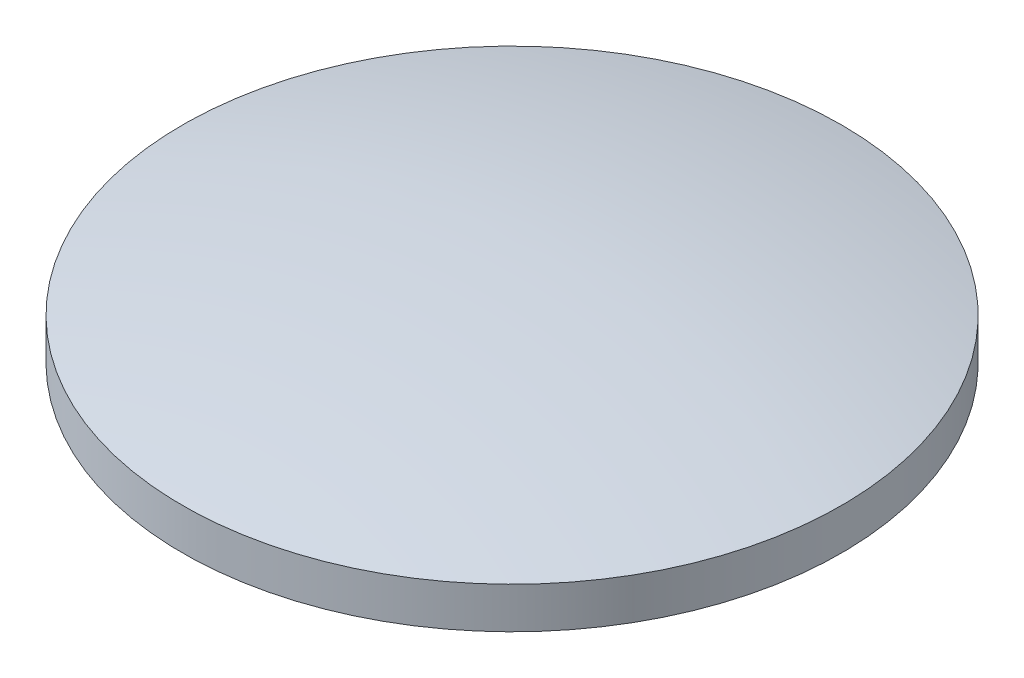
ISO-10303-21;
HEADER;
FILE_DESCRIPTION(('STEP AP214'),'2;1');
FILE_NAME('part.step','',(''),(''),'','','');
FILE_SCHEMA(('AUTOMOTIVE_DESIGN { 1 0 10303 214 1 1 1 1 }'));
ENDSEC;
DATA;
#1=APPLICATION_CONTEXT('core data for automotive mechanical design processes');
#2=APPLICATION_PROTOCOL_DEFINITION('international standard','automotive_design',2000,#1);
#3=PRODUCT_CONTEXT('',#1,'mechanical');
#4=PRODUCT('Part','Part','',(#3));
#5=PRODUCT_RELATED_PRODUCT_CATEGORY('part','',(#4));
#6=PRODUCT_DEFINITION_FORMATION('','',#4);
#7=PRODUCT_DEFINITION_CONTEXT('part definition',#1,'design');
#8=PRODUCT_DEFINITION('design','',#6,#7);
#9=PRODUCT_DEFINITION_SHAPE('','',#8);
#10=(LENGTH_UNIT() NAMED_UNIT(*) SI_UNIT(.MILLI.,.METRE.));
#11=(NAMED_UNIT(*) PLANE_ANGLE_UNIT() SI_UNIT($,.RADIAN.));
#12=(NAMED_UNIT(*) SI_UNIT($,.STERADIAN.) SOLID_ANGLE_UNIT());
#13=UNCERTAINTY_MEASURE_WITH_UNIT(LENGTH_MEASURE(1.E-05),#10,'distance_accuracy_value','');
#14=(GEOMETRIC_REPRESENTATION_CONTEXT(3) GLOBAL_UNCERTAINTY_ASSIGNED_CONTEXT((#13)) GLOBAL_UNIT_ASSIGNED_CONTEXT((#10,
#11,#12)) REPRESENTATION_CONTEXT('',''));
#15=CARTESIAN_POINT('',(0.,0.,0.));
#16=DIRECTION('',(0.,0.,1.));
#17=DIRECTION('',(1.,0.,0.));
#18=AXIS2_PLACEMENT_3D('',#15,#16,#17);
#19=CARTESIAN_POINT('',(0.,-31.,0.));
#20=DIRECTION('',(1.,0.,0.));
#21=DIRECTION('',(0.,1.,0.));
#22=AXIS2_PLACEMENT_3D('',#19,#20,#21);
#23=SPHERICAL_SURFACE('',#22,32.5);
#24=CARTESIAN_POINT('',(0.,0.5,0.));
#25=DIRECTION('',(0.,-1.,0.));
#26=DIRECTION('',(0.,0.,-1.));
#27=AXIS2_PLACEMENT_3D('',#24,#25,#26);
#28=CIRCLE('',#27,8.);
#29=CARTESIAN_POINT('',(0.,0.5,-8.));
#30=VERTEX_POINT('',#29);
#31=EDGE_CURVE('E23',#30,#30,#28,.T.);
#32=ORIENTED_EDGE('',*,*,#31,.F.);
#33=EDGE_LOOP('',(#32));
#34=FACE_BOUND('',#33,.T.);
#35=ADVANCED_FACE('F15',(#34),#23,.T.);
#36=CARTESIAN_POINT('',(0.,0.,0.));
#37=DIRECTION('',(0.,-1.,0.));
#38=DIRECTION('',(0.,0.,-1.));
#39=AXIS2_PLACEMENT_3D('',#36,#37,#38);
#40=CYLINDRICAL_SURFACE('',#39,8.);
#41=ORIENTED_EDGE('',*,*,#31,.T.);
#42=EDGE_LOOP('',(#41));
#43=FACE_BOUND('',#42,.T.);
#44=CARTESIAN_POINT('',(0.,-0.5,0.));
#45=DIRECTION('',(0.,-1.,0.));
#46=DIRECTION('',(0.,0.,-1.));
#47=AXIS2_PLACEMENT_3D('',#44,#45,#46);
#48=CIRCLE('',#47,8.);
#49=CARTESIAN_POINT('',(0.,-0.5,-8.));
#50=VERTEX_POINT('',#49);
#51=EDGE_CURVE('E10',#50,#50,#48,.T.);
#52=ORIENTED_EDGE('',*,*,#51,.F.);
#53=EDGE_LOOP('',(#52));
#54=FACE_BOUND('',#53,.T.);
#55=ADVANCED_FACE('F34',(#43,#54),#40,.T.);
#56=CARTESIAN_POINT('',(0.,31.,0.));
#57=DIRECTION('',(-1.,0.,0.));
#58=DIRECTION('',(0.,-1.,0.));
#59=AXIS2_PLACEMENT_3D('',#56,#57,#58);
#60=SPHERICAL_SURFACE('',#59,32.5);
#61=ORIENTED_EDGE('',*,*,#51,.T.);
#62=EDGE_LOOP('',(#61));
#63=FACE_BOUND('',#62,.T.);
#64=ADVANCED_FACE('F32',(#63),#60,.T.);
#65=CLOSED_SHELL('',(#35,#55,#64));
#66=MANIFOLD_SOLID_BREP('B1',#65);
#67=ADVANCED_BREP_SHAPE_REPRESENTATION('',(#18,#66),#14);
#68=SHAPE_DEFINITION_REPRESENTATION(#9,#67);
ENDSEC;
END-ISO-10303-21;
